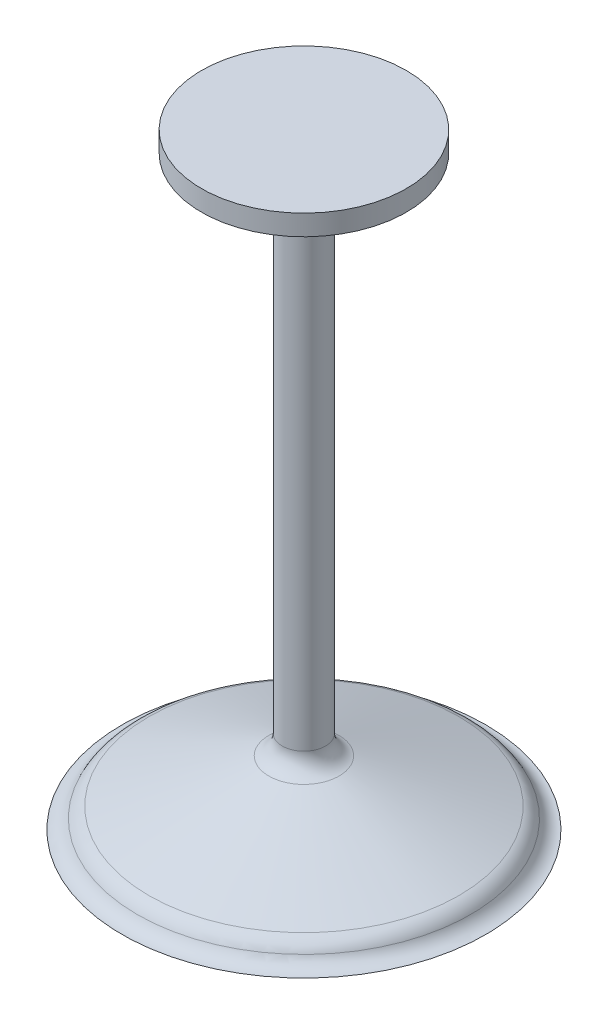
ISO-10303-21;
HEADER;
FILE_DESCRIPTION(('STEP AP214'),'2;1');
FILE_NAME('part.step','',(''),(''),'','','');
FILE_SCHEMA(('AUTOMOTIVE_DESIGN { 1 0 10303 214 1 1 1 1 }'));
ENDSEC;
DATA;
#1=APPLICATION_CONTEXT('core data for automotive mechanical design processes');
#2=APPLICATION_PROTOCOL_DEFINITION('international standard','automotive_design',2000,#1);
#3=PRODUCT_CONTEXT('',#1,'mechanical');
#4=PRODUCT('Part','Part','',(#3));
#5=PRODUCT_RELATED_PRODUCT_CATEGORY('part','',(#4));
#6=PRODUCT_DEFINITION_FORMATION('','',#4);
#7=PRODUCT_DEFINITION_CONTEXT('part definition',#1,'design');
#8=PRODUCT_DEFINITION('design','',#6,#7);
#9=PRODUCT_DEFINITION_SHAPE('','',#8);
#10=(LENGTH_UNIT() NAMED_UNIT(*) SI_UNIT(.MILLI.,.METRE.));
#11=(NAMED_UNIT(*) PLANE_ANGLE_UNIT() SI_UNIT($,.RADIAN.));
#12=(NAMED_UNIT(*) SI_UNIT($,.STERADIAN.) SOLID_ANGLE_UNIT());
#13=UNCERTAINTY_MEASURE_WITH_UNIT(LENGTH_MEASURE(1.E-05),#10,'distance_accuracy_value','');
#14=(GEOMETRIC_REPRESENTATION_CONTEXT(3) GLOBAL_UNCERTAINTY_ASSIGNED_CONTEXT((#13)) GLOBAL_UNIT_ASSIGNED_CONTEXT((#10,
#11,#12)) REPRESENTATION_CONTEXT('',''));
#15=CARTESIAN_POINT('',(0.,0.,0.));
#16=DIRECTION('',(0.,0.,1.));
#17=DIRECTION('',(1.,0.,0.));
#18=AXIS2_PLACEMENT_3D('',#15,#16,#17);
#19=CARTESIAN_POINT('',(15.,88.8,0.));
#20=DIRECTION('',(0.,1.,0.));
#21=DIRECTION('',(0.,0.,1.));
#22=AXIS2_PLACEMENT_3D('',#19,#20,#21);
#23=PLANE('',#22);
#24=CARTESIAN_POINT('',(0.,88.8,0.));
#25=DIRECTION('',(0.,-1.,0.));
#26=DIRECTION('',(0.,0.,-1.));
#27=AXIS2_PLACEMENT_3D('',#24,#25,#26);
#28=CIRCLE('',#27,15.);
#29=CARTESIAN_POINT('',(0.,88.8,-15.));
#30=VERTEX_POINT('',#29);
#31=EDGE_CURVE('E11',#30,#30,#28,.T.);
#32=ORIENTED_EDGE('',*,*,#31,.F.);
#33=EDGE_LOOP('',(#32));
#34=FACE_BOUND('',#33,.T.);
#35=ADVANCED_FACE('F34',(#34),#23,.T.);
#36=CARTESIAN_POINT('',(0.,-88.8,0.));
#37=DIRECTION('',(0.,-1.,0.));
#38=DIRECTION('',(0.,0.,-1.));
#39=AXIS2_PLACEMENT_3D('',#36,#37,#38);
#40=CYLINDRICAL_SURFACE('',#39,15.);
#41=ORIENTED_EDGE('',*,*,#31,.T.);
#42=EDGE_LOOP('',(#41));
#43=FACE_BOUND('',#42,.T.);
#44=CARTESIAN_POINT('',(0.,85.8,0.));
#45=DIRECTION('',(0.,-1.,0.));
#46=DIRECTION('',(0.,0.,-1.));
#47=AXIS2_PLACEMENT_3D('',#44,#45,#46);
#48=CIRCLE('',#47,15.);
#49=CARTESIAN_POINT('',(0.,85.8,-15.));
#50=VERTEX_POINT('',#49);
#51=EDGE_CURVE('E40',#50,#50,#48,.T.);
#52=ORIENTED_EDGE('',*,*,#51,.F.);
#53=EDGE_LOOP('',(#52));
#54=FACE_BOUND('',#53,.T.);
#55=ADVANCED_FACE('F56',(#43,#54),#40,.T.);
#56=CARTESIAN_POINT('',(3.17500000000003,85.8,0.));
#57=DIRECTION('',(0.,-1.,0.));
#58=DIRECTION('',(0.,0.,-1.));
#59=AXIS2_PLACEMENT_3D('',#56,#57,#58);
#60=PLANE('',#59);
#61=ORIENTED_EDGE('',*,*,#51,.T.);
#62=EDGE_LOOP('',(#61));
#63=FACE_BOUND('',#62,.T.);
#64=CARTESIAN_POINT('',(0.,85.8,0.));
#65=DIRECTION('',(0.,-1.,0.));
#66=DIRECTION('',(0.,0.,-1.));
#67=AXIS2_PLACEMENT_3D('',#64,#65,#66);
#68=CIRCLE('',#67,3.17500000000002);
#69=CARTESIAN_POINT('',(0.,85.8,-3.17500000000002));
#70=VERTEX_POINT('',#69);
#71=EDGE_CURVE('E68',#70,#70,#68,.T.);
#72=ORIENTED_EDGE('',*,*,#71,.F.);
#73=EDGE_LOOP('',(#72));
#74=FACE_BOUND('',#73,.T.);
#75=ADVANCED_FACE('F61',(#63,#74),#60,.T.);
#76=CARTESIAN_POINT('',(0.,-88.8,0.));
#77=DIRECTION('',(0.,-1.,0.));
#78=DIRECTION('',(0.,0.,-1.));
#79=AXIS2_PLACEMENT_3D('',#76,#77,#78);
#80=CYLINDRICAL_SURFACE('',#79,3.17500000000002);
#81=ORIENTED_EDGE('',*,*,#71,.T.);
#82=EDGE_LOOP('',(#81));
#83=FACE_BOUND('',#82,.T.);
#84=CARTESIAN_POINT('',(0.,12.1939975342193,0.));
#85=DIRECTION('',(0.,-1.,0.));
#86=DIRECTION('',(0.,0.,-1.));
#87=AXIS2_PLACEMENT_3D('',#84,#85,#86);
#88=CIRCLE('',#87,3.17500000000002);
#89=CARTESIAN_POINT('',(0.,12.1939975342193,-3.17500000000002));
#90=VERTEX_POINT('',#89);
#91=EDGE_CURVE('E70',#90,#90,#88,.T.);
#92=ORIENTED_EDGE('',*,*,#91,.F.);
#93=EDGE_LOOP('',(#92));
#94=FACE_BOUND('',#93,.T.);
#95=ADVANCED_FACE('F116',(#83,#94),#80,.T.);
#96=CARTESIAN_POINT('',(0.,12.1939975342193,0.));
#97=DIRECTION('',(0.,-1.,0.));
#98=DIRECTION('',(0.,0.,-1.));
#99=AXIS2_PLACEMENT_3D('',#96,#97,#98);
#100=TOROIDAL_SURFACE('',#99,6.17500000000002,3.);
#101=ORIENTED_EDGE('',*,*,#91,.T.);
#102=EDGE_LOOP('',(#101));
#103=FACE_BOUND('',#102,.T.);
#104=CARTESIAN_POINT('',(0.,9.37491967186158,0.));
#105=DIRECTION('',(0.,-1.,0.));
#106=DIRECTION('',(0.,0.,-1.));
#107=AXIS2_PLACEMENT_3D('',#104,#105,#106);
#108=CIRCLE('',#107,5.14893957002303);
#109=CARTESIAN_POINT('',(0.,9.37491967186158,-5.14893957002303));
#110=VERTEX_POINT('',#109);
#111=EDGE_CURVE('E75',#110,#110,#108,.T.);
#112=ORIENTED_EDGE('',*,*,#111,.F.);
#113=EDGE_LOOP('',(#112));
#114=FACE_BOUND('',#113,.T.);
#115=ADVANCED_FACE('F112',(#103,#114),#100,.F.);
#116=CARTESIAN_POINT('',(0.,2.98601508693615,0.));
#117=DIRECTION('',(0.,-1.,0.));
#118=DIRECTION('',(0.,0.,-1.));
#119=AXIS2_PLACEMENT_3D('',#116,#117,#118);
#120=CONICAL_SURFACE('',#119,22.7023106521559,1.22173047639603);
#121=ORIENTED_EDGE('',*,*,#111,.T.);
#122=EDGE_LOOP('',(#121));
#123=FACE_BOUND('',#122,.T.);
#124=CARTESIAN_POINT('',(0.,2.98601508693615,0.));
#125=DIRECTION('',(0.,-1.,0.));
#126=DIRECTION('',(0.,0.,-1.));
#127=AXIS2_PLACEMENT_3D('',#124,#125,#126);
#128=CIRCLE('',#127,22.7023106521559);
#129=CARTESIAN_POINT('',(0.,2.98601508693615,-22.7023106521559));
#130=VERTEX_POINT('',#129);
#131=EDGE_CURVE('E78',#130,#130,#128,.T.);
#132=ORIENTED_EDGE('',*,*,#131,.F.);
#133=EDGE_LOOP('',(#132));
#134=FACE_BOUND('',#133,.T.);
#135=ADVANCED_FACE('F108',(#123,#134),#120,.T.);
#136=CARTESIAN_POINT('',(0.,0.166937224578423,0.));
#137=DIRECTION('',(0.,-1.,0.));
#138=DIRECTION('',(0.,0.,-1.));
#139=AXIS2_PLACEMENT_3D('',#136,#137,#138);
#140=TOROIDAL_SURFACE('',#139,21.6762502221789,3.);
#141=ORIENTED_EDGE('',*,*,#131,.T.);
#142=EDGE_LOOP('',(#141));
#143=FACE_BOUND('',#142,.T.);
#144=CARTESIAN_POINT('',(0.,1.42366902756277,0.));
#145=DIRECTION('',(0.,-1.,0.));
#146=DIRECTION('',(0.,0.,-1.));
#147=AXIS2_PLACEMENT_3D('',#144,#145,#146);
#148=CIRCLE('',#147,24.4003326686859);
#149=CARTESIAN_POINT('',(0.,1.42366902756277,-24.4003326686859));
#150=VERTEX_POINT('',#149);
#151=EDGE_CURVE('E81',#150,#150,#148,.T.);
#152=ORIENTED_EDGE('',*,*,#151,.F.);
#153=EDGE_LOOP('',(#152));
#154=FACE_BOUND('',#153,.T.);
#155=ADVANCED_FACE('F102',(#143,#154),#140,.T.);
#156=CARTESIAN_POINT('',(0.,2.45,0.));
#157=DIRECTION('',(0.,-1.,0.));
#158=DIRECTION('',(0.,0.,-1.));
#159=AXIS2_PLACEMENT_3D('',#156,#157,#158);
#160=TOROIDAL_SURFACE('',#159,26.625,2.45);
#161=ORIENTED_EDGE('',*,*,#151,.T.);
#162=EDGE_LOOP('',(#161));
#163=FACE_BOUND('',#162,.T.);
#164=CARTESIAN_POINT('',(0.,0.,0.));
#165=DIRECTION('',(0.,-1.,0.));
#166=DIRECTION('',(0.,0.,-1.));
#167=AXIS2_PLACEMENT_3D('',#164,#165,#166);
#168=CIRCLE('',#167,26.625);
#169=CARTESIAN_POINT('',(0.,0.,-26.625));
#170=VERTEX_POINT('',#169);
#171=EDGE_CURVE('E84',#170,#170,#168,.T.);
#172=ORIENTED_EDGE('',*,*,#171,.F.);
#173=EDGE_LOOP('',(#172));
#174=FACE_BOUND('',#173,.T.);
#175=ADVANCED_FACE('F96',(#163,#174),#160,.F.);
#176=CARTESIAN_POINT('',(23.5181150504641,0.,0.));
#177=DIRECTION('',(0.,-1.,0.));
#178=DIRECTION('',(0.,0.,-1.));
#179=AXIS2_PLACEMENT_3D('',#176,#177,#178);
#180=PLANE('',#179);
#181=ORIENTED_EDGE('',*,*,#171,.T.);
#182=EDGE_LOOP('',(#181));
#183=FACE_BOUND('',#182,.T.);
#184=CARTESIAN_POINT('',(0.,0.,0.));
#185=DIRECTION('',(0.,-1.,0.));
#186=DIRECTION('',(0.,0.,-1.));
#187=AXIS2_PLACEMENT_3D('',#184,#185,#186);
#188=CIRCLE('',#187,23.5181150504641);
#189=CARTESIAN_POINT('',(0.,0.,-23.5181150504641));
#190=VERTEX_POINT('',#189);
#191=EDGE_CURVE('E87',#190,#190,#188,.T.);
#192=ORIENTED_EDGE('',*,*,#191,.F.);
#193=EDGE_LOOP('',(#192));
#194=FACE_BOUND('',#193,.T.);
#195=ADVANCED_FACE('F51',(#183,#194),#180,.T.);
#196=CARTESIAN_POINT('',(0.,20.,0.));
#197=DIRECTION('',(0.,-1.,0.));
#198=DIRECTION('',(0.,0.,-1.));
#199=AXIS2_PLACEMENT_3D('',#196,#197,#198);
#200=TOROIDAL_SURFACE('',#199,23.5181150504641,20.);
#201=ORIENTED_EDGE('',*,*,#191,.T.);
#202=EDGE_LOOP('',(#201));
#203=FACE_BOUND('',#202,.T.);
#204=CARTESIAN_POINT('',(0.,1.61353264594435,0.));
#205=DIRECTION('',(0.,-1.,0.));
#206=DIRECTION('',(0.,0.,-1.));
#207=AXIS2_PLACEMENT_3D('',#204,#205,#206);
#208=CIRCLE('',#207,15.6480567127993);
#209=CARTESIAN_POINT('',(0.,1.61353264594435,-15.6480567127993));
#210=VERTEX_POINT('',#209);
#211=EDGE_CURVE('E90',#210,#210,#208,.T.);
#212=ORIENTED_EDGE('',*,*,#211,.F.);
#213=EDGE_LOOP('',(#212));
#214=FACE_BOUND('',#213,.T.);
#215=ADVANCED_FACE('F45',(#203,#214),#200,.T.);
#216=CARTESIAN_POINT('',(0.,-37.0899811343428,0.918416087984949));
#217=DIRECTION('',(-1.,0.,0.));
#218=DIRECTION('',(0.,0.,-1.));
#219=AXIS2_PLACEMENT_3D('',#216,#217,#218);
#220=CIRCLE('',#219,42.1);
#221=TRIMMED_CURVE('',#220,(PARAMETER_VALUE(-1.54897948714796)),
(PARAMETER_VALUE(1.54897948714796)),.T.,.PARAMETER.);
#222=CARTESIAN_POINT('',(0.,-37.0899811343428,0.));
#223=DIRECTION('',(0.,-1.,0.));
#224=AXIS1_PLACEMENT('',#222,#223);
#225=SURFACE_OF_REVOLUTION('',#221,#224);
#226=ORIENTED_EDGE('',*,*,#211,.T.);
#227=EDGE_LOOP('',(#226));
#228=FACE_BOUND('',#227,.T.);
#229=CARTESIAN_POINT('',(0.,5.00000000000001,0.));
#230=VERTEX_POINT('',#229);
#231=VERTEX_LOOP('',#230);
#232=FACE_BOUND('',#231,.T.);
#233=ADVANCED_FACE('F43',(#228,#232),#225,.F.);
#234=CLOSED_SHELL('',(#35,#55,#75,#95,#115,#135,#155,#175,#195,#215,#233));
#235=MANIFOLD_SOLID_BREP('B2',#234);
#236=ADVANCED_BREP_SHAPE_REPRESENTATION('',(#18,#235),#14);
#237=SHAPE_DEFINITION_REPRESENTATION(#9,#236);
ENDSEC;
END-ISO-10303-21;
